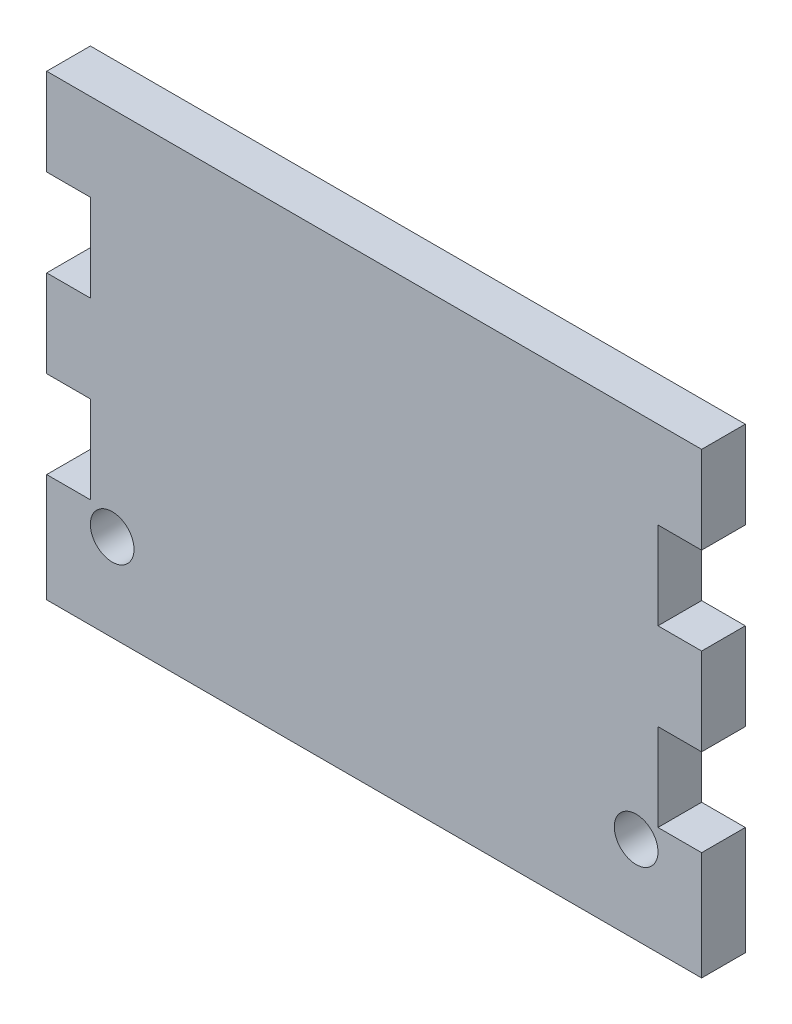
ISO-10303-21;
HEADER;
FILE_DESCRIPTION(('STEP AP214'),'2;1');
FILE_NAME('part.step','',(''),(''),'','','');
FILE_SCHEMA(('AUTOMOTIVE_DESIGN { 1 0 10303 214 1 1 1 1 }'));
ENDSEC;
DATA;
#1=APPLICATION_CONTEXT('core data for automotive mechanical design processes');
#2=APPLICATION_PROTOCOL_DEFINITION('international standard','automotive_design',2000,#1);
#3=PRODUCT_CONTEXT('',#1,'mechanical');
#4=PRODUCT('Part','Part','',(#3));
#5=PRODUCT_RELATED_PRODUCT_CATEGORY('part','',(#4));
#6=PRODUCT_DEFINITION_FORMATION('','',#4);
#7=PRODUCT_DEFINITION_CONTEXT('part definition',#1,'design');
#8=PRODUCT_DEFINITION('design','',#6,#7);
#9=PRODUCT_DEFINITION_SHAPE('','',#8);
#10=(LENGTH_UNIT() NAMED_UNIT(*) SI_UNIT(.MILLI.,.METRE.));
#11=(NAMED_UNIT(*) PLANE_ANGLE_UNIT() SI_UNIT($,.RADIAN.));
#12=(NAMED_UNIT(*) SI_UNIT($,.STERADIAN.) SOLID_ANGLE_UNIT());
#13=UNCERTAINTY_MEASURE_WITH_UNIT(LENGTH_MEASURE(1.E-05),#10,'distance_accuracy_value','');
#14=(GEOMETRIC_REPRESENTATION_CONTEXT(3) GLOBAL_UNCERTAINTY_ASSIGNED_CONTEXT((#13)) GLOBAL_UNIT_ASSIGNED_CONTEXT((#10,
#11,#12)) REPRESENTATION_CONTEXT('',''));
#15=CARTESIAN_POINT('',(0.,0.,0.));
#16=DIRECTION('',(0.,0.,1.));
#17=DIRECTION('',(1.,0.,0.));
#18=AXIS2_PLACEMENT_3D('',#15,#16,#17);
#19=CARTESIAN_POINT('',(95.25,0.,6.35));
#20=DIRECTION('',(-1.,0.,0.));
#21=DIRECTION('',(0.,0.,1.));
#22=AXIS2_PLACEMENT_3D('',#19,#20,#21);
#23=PLANE('',#22);
#24=DIRECTION('',(0.,1.,0.));
#25=VECTOR('',#24,1.);
#26=CARTESIAN_POINT('',(95.25,0.,0.));
#27=LINE('',#26,#25);
#28=CARTESIAN_POINT('',(95.25,-104.683822381819,0.));
#29=VERTEX_POINT('',#28);
#30=CARTESIAN_POINT('',(95.25,-88.9,0.));
#31=VERTEX_POINT('',#30);
#32=EDGE_CURVE('E40',#29,#31,#27,.T.);
#33=ORIENTED_EDGE('',*,*,#32,.T.);
#34=DIRECTION('',(0.,0.,1.));
#35=VECTOR('',#34,1.);
#36=CARTESIAN_POINT('',(95.25,-88.9,0.));
#37=LINE('',#36,#35);
#38=CARTESIAN_POINT('',(95.25,-88.9,6.35));
#39=VERTEX_POINT('',#38);
#40=EDGE_CURVE('E310',#31,#39,#37,.T.);
#41=ORIENTED_EDGE('',*,*,#40,.T.);
#42=DIRECTION('',(0.,1.,0.));
#43=VECTOR('',#42,1.);
#44=CARTESIAN_POINT('',(95.25,0.,6.35));
#45=LINE('',#44,#43);
#46=CARTESIAN_POINT('',(95.25,-104.683822381819,6.35));
#47=VERTEX_POINT('',#46);
#48=EDGE_CURVE('E11',#47,#39,#45,.T.);
#49=ORIENTED_EDGE('',*,*,#48,.F.);
#50=DIRECTION('',(0.,0.,1.));
#51=VECTOR('',#50,1.);
#52=CARTESIAN_POINT('',(95.25,-104.683822381819,0.));
#53=LINE('',#52,#51);
#54=EDGE_CURVE('E217',#29,#47,#53,.T.);
#55=ORIENTED_EDGE('',*,*,#54,.F.);
#56=EDGE_LOOP('',(#33,#41,#49,#55));
#57=FACE_BOUND('',#56,.T.);
#58=ADVANCED_FACE('F36',(#57),#23,.F.);
#59=CARTESIAN_POINT('',(0.,0.,6.35));
#60=DIRECTION('',(1.,0.,0.));
#61=DIRECTION('',(0.,0.,-1.));
#62=AXIS2_PLACEMENT_3D('',#59,#60,#61);
#63=PLANE('',#62);
#64=DIRECTION('',(0.,-1.,0.));
#65=VECTOR('',#64,1.);
#66=CARTESIAN_POINT('',(0.,0.,0.));
#67=LINE('',#66,#65);
#68=CARTESIAN_POINT('',(0.,-63.5,0.));
#69=VERTEX_POINT('',#68);
#70=CARTESIAN_POINT('',(0.,-76.2,0.));
#71=VERTEX_POINT('',#70);
#72=EDGE_CURVE('E210',#69,#71,#67,.T.);
#73=ORIENTED_EDGE('',*,*,#72,.T.);
#74=DIRECTION('',(0.,0.,1.));
#75=VECTOR('',#74,1.);
#76=CARTESIAN_POINT('',(0.,-76.2,0.));
#77=LINE('',#76,#75);
#78=CARTESIAN_POINT('',(0.,-76.2,6.35));
#79=VERTEX_POINT('',#78);
#80=EDGE_CURVE('E335',#71,#79,#77,.T.);
#81=ORIENTED_EDGE('',*,*,#80,.T.);
#82=DIRECTION('',(0.,-1.,0.));
#83=VECTOR('',#82,1.);
#84=CARTESIAN_POINT('',(0.,0.,6.35));
#85=LINE('',#84,#83);
#86=CARTESIAN_POINT('',(0.,-63.5,6.35));
#87=VERTEX_POINT('',#86);
#88=EDGE_CURVE('E236',#87,#79,#85,.T.);
#89=ORIENTED_EDGE('',*,*,#88,.F.);
#90=DIRECTION('',(0.,0.,1.));
#91=VECTOR('',#90,1.);
#92=CARTESIAN_POINT('',(0.,-63.5,0.));
#93=LINE('',#92,#91);
#94=EDGE_CURVE('E284',#69,#87,#93,.T.);
#95=ORIENTED_EDGE('',*,*,#94,.F.);
#96=EDGE_LOOP('',(#73,#81,#89,#95));
#97=FACE_BOUND('',#96,.T.);
#98=ADVANCED_FACE('F372',(#97),#63,.F.);
#99=CARTESIAN_POINT('',(95.25,-76.2,6.35));
#100=VERTEX_POINT('',#99);
#101=CARTESIAN_POINT('',(95.25,-63.5,6.35));
#102=VERTEX_POINT('',#101);
#103=EDGE_CURVE('E45',#100,#102,#45,.T.);
#104=ORIENTED_EDGE('',*,*,#103,.F.);
#105=DIRECTION('',(0.,0.,1.));
#106=VECTOR('',#105,1.);
#107=CARTESIAN_POINT('',(95.25,-76.2,0.));
#108=LINE('',#107,#106);
#109=CARTESIAN_POINT('',(95.25,-76.2,0.));
#110=VERTEX_POINT('',#109);
#111=EDGE_CURVE('E54',#110,#100,#108,.T.);
#112=ORIENTED_EDGE('',*,*,#111,.F.);
#113=CARTESIAN_POINT('',(95.25,-63.5,0.));
#114=VERTEX_POINT('',#113);
#115=EDGE_CURVE('E189',#110,#114,#27,.T.);
#116=ORIENTED_EDGE('',*,*,#115,.T.);
#117=DIRECTION('',(0.,0.,1.));
#118=VECTOR('',#117,1.);
#119=CARTESIAN_POINT('',(95.25,-63.5,0.));
#120=LINE('',#119,#118);
#121=EDGE_CURVE('E257',#114,#102,#120,.T.);
#122=ORIENTED_EDGE('',*,*,#121,.T.);
#123=EDGE_LOOP('',(#104,#112,#116,#122));
#124=FACE_BOUND('',#123,.T.);
#125=ADVANCED_FACE('F187',(#124),#23,.F.);
#126=CARTESIAN_POINT('',(0.,-38.1,0.));
#127=VERTEX_POINT('',#126);
#128=CARTESIAN_POINT('',(0.,-50.8,0.));
#129=VERTEX_POINT('',#128);
#130=EDGE_CURVE('E203',#127,#129,#67,.T.);
#131=ORIENTED_EDGE('',*,*,#130,.T.);
#132=DIRECTION('',(0.,0.,1.));
#133=VECTOR('',#132,1.);
#134=CARTESIAN_POINT('',(0.,-50.8,0.));
#135=LINE('',#134,#133);
#136=CARTESIAN_POINT('',(0.,-50.8,6.35));
#137=VERTEX_POINT('',#136);
#138=EDGE_CURVE('E289',#129,#137,#135,.T.);
#139=ORIENTED_EDGE('',*,*,#138,.T.);
#140=CARTESIAN_POINT('',(0.,-38.1,6.35));
#141=VERTEX_POINT('',#140);
#142=EDGE_CURVE('E237',#141,#137,#85,.T.);
#143=ORIENTED_EDGE('',*,*,#142,.F.);
#144=DIRECTION('',(0.,0.,1.));
#145=VECTOR('',#144,1.);
#146=CARTESIAN_POINT('',(0.,-38.1,0.));
#147=LINE('',#146,#145);
#148=EDGE_CURVE('E301',#127,#141,#147,.T.);
#149=ORIENTED_EDGE('',*,*,#148,.F.);
#150=EDGE_LOOP('',(#131,#139,#143,#149));
#151=FACE_BOUND('',#150,.T.);
#152=ADVANCED_FACE('F357',(#151),#63,.F.);
#153=CARTESIAN_POINT('',(95.25,-50.8,6.35));
#154=VERTEX_POINT('',#153);
#155=CARTESIAN_POINT('',(95.25,-38.1,6.35));
#156=VERTEX_POINT('',#155);
#157=EDGE_CURVE('E47',#154,#156,#45,.T.);
#158=ORIENTED_EDGE('',*,*,#157,.F.);
#159=DIRECTION('',(0.,0.,1.));
#160=VECTOR('',#159,1.);
#161=CARTESIAN_POINT('',(95.25,-50.8,0.));
#162=LINE('',#161,#160);
#163=CARTESIAN_POINT('',(95.25,-50.8,0.));
#164=VERTEX_POINT('',#163);
#165=EDGE_CURVE('E273',#164,#154,#162,.T.);
#166=ORIENTED_EDGE('',*,*,#165,.F.);
#167=CARTESIAN_POINT('',(95.25,-38.1,0.));
#168=VERTEX_POINT('',#167);
#169=EDGE_CURVE('E199',#164,#168,#27,.T.);
#170=ORIENTED_EDGE('',*,*,#169,.T.);
#171=DIRECTION('',(0.,0.,1.));
#172=VECTOR('',#171,1.);
#173=CARTESIAN_POINT('',(95.25,-38.1,0.));
#174=LINE('',#173,#172);
#175=EDGE_CURVE('E291',#168,#156,#174,.T.);
#176=ORIENTED_EDGE('',*,*,#175,.T.);
#177=EDGE_LOOP('',(#158,#166,#170,#176));
#178=FACE_BOUND('',#177,.T.);
#179=ADVANCED_FACE('F354',(#178),#23,.F.);
#180=CARTESIAN_POINT('',(0.,0.,0.));
#181=DIRECTION('',(0.,0.,-1.));
#182=DIRECTION('',(-1.,0.,0.));
#183=AXIS2_PLACEMENT_3D('',#180,#181,#182);
#184=PLANE('',#183);
#185=DIRECTION('',(1.,0.,0.));
#186=VECTOR('',#185,1.);
#187=CARTESIAN_POINT('',(0.,-38.1,0.));
#188=LINE('',#187,#186);
#189=EDGE_CURVE('E299',#127,#168,#188,.T.);
#190=ORIENTED_EDGE('',*,*,#189,.T.);
#191=ORIENTED_EDGE('',*,*,#169,.F.);
#192=DIRECTION('',(-1.,0.,0.));
#193=VECTOR('',#192,1.);
#194=CARTESIAN_POINT('',(95.25,-50.8,0.));
#195=LINE('',#194,#193);
#196=CARTESIAN_POINT('',(88.9,-50.8,0.));
#197=VERTEX_POINT('',#196);
#198=EDGE_CURVE('E260',#164,#197,#195,.T.);
#199=ORIENTED_EDGE('',*,*,#198,.T.);
#200=DIRECTION('',(0.,-1.,0.));
#201=VECTOR('',#200,1.);
#202=CARTESIAN_POINT('',(88.9,-50.8,0.));
#203=LINE('',#202,#201);
#204=CARTESIAN_POINT('',(88.9,-63.5,0.));
#205=VERTEX_POINT('',#204);
#206=EDGE_CURVE('E346',#197,#205,#203,.T.);
#207=ORIENTED_EDGE('',*,*,#206,.T.);
#208=DIRECTION('',(1.,0.,0.));
#209=VECTOR('',#208,1.);
#210=CARTESIAN_POINT('',(95.25,-63.5,0.));
#211=LINE('',#210,#209);
#212=EDGE_CURVE('E198',#205,#114,#211,.T.);
#213=ORIENTED_EDGE('',*,*,#212,.T.);
#214=ORIENTED_EDGE('',*,*,#115,.F.);
#215=DIRECTION('',(-1.,0.,0.));
#216=VECTOR('',#215,1.);
#217=CARTESIAN_POINT('',(95.25,-76.2,0.));
#218=LINE('',#217,#216);
#219=CARTESIAN_POINT('',(88.9,-76.2,0.));
#220=VERTEX_POINT('',#219);
#221=EDGE_CURVE('E175',#110,#220,#218,.T.);
#222=ORIENTED_EDGE('',*,*,#221,.T.);
#223=DIRECTION('',(0.,-1.,0.));
#224=VECTOR('',#223,1.);
#225=CARTESIAN_POINT('',(88.9,-76.2,0.));
#226=LINE('',#225,#224);
#227=CARTESIAN_POINT('',(88.9,-88.9,0.));
#228=VERTEX_POINT('',#227);
#229=EDGE_CURVE('E182',#220,#228,#226,.T.);
#230=ORIENTED_EDGE('',*,*,#229,.T.);
#231=DIRECTION('',(1.,0.,0.));
#232=VECTOR('',#231,1.);
#233=CARTESIAN_POINT('',(95.25,-88.9,0.));
#234=LINE('',#233,#232);
#235=EDGE_CURVE('E191',#228,#31,#234,.T.);
#236=ORIENTED_EDGE('',*,*,#235,.T.);
#237=ORIENTED_EDGE('',*,*,#32,.F.);
#238=DIRECTION('',(1.,0.,0.));
#239=VECTOR('',#238,1.);
#240=CARTESIAN_POINT('',(0.,-104.683822381819,0.));
#241=LINE('',#240,#239);
#242=CARTESIAN_POINT('',(0.,-104.683822381819,0.));
#243=VERTEX_POINT('',#242);
#244=EDGE_CURVE('E230',#243,#29,#241,.T.);
#245=ORIENTED_EDGE('',*,*,#244,.F.);
#246=CARTESIAN_POINT('',(0.,-88.9,0.));
#247=VERTEX_POINT('',#246);
#248=EDGE_CURVE('E211',#247,#243,#67,.T.);
#249=ORIENTED_EDGE('',*,*,#248,.F.);
#250=DIRECTION('',(1.,0.,0.));
#251=VECTOR('',#250,1.);
#252=CARTESIAN_POINT('',(0.,-88.9,0.));
#253=LINE('',#252,#251);
#254=CARTESIAN_POINT('',(6.35,-88.9,0.));
#255=VERTEX_POINT('',#254);
#256=EDGE_CURVE('E62',#247,#255,#253,.T.);
#257=ORIENTED_EDGE('',*,*,#256,.T.);
#258=DIRECTION('',(0.,1.,0.));
#259=VECTOR('',#258,1.);
#260=CARTESIAN_POINT('',(6.35,-76.2,0.));
#261=LINE('',#260,#259);
#262=CARTESIAN_POINT('',(6.35,-76.2,0.));
#263=VERTEX_POINT('',#262);
#264=EDGE_CURVE('E324',#255,#263,#261,.T.);
#265=ORIENTED_EDGE('',*,*,#264,.T.);
#266=DIRECTION('',(-1.,0.,0.));
#267=VECTOR('',#266,1.);
#268=CARTESIAN_POINT('',(0.,-76.2,0.));
#269=LINE('',#268,#267);
#270=EDGE_CURVE('E328',#263,#71,#269,.T.);
#271=ORIENTED_EDGE('',*,*,#270,.T.);
#272=ORIENTED_EDGE('',*,*,#72,.F.);
#273=DIRECTION('',(1.,0.,0.));
#274=VECTOR('',#273,1.);
#275=CARTESIAN_POINT('',(0.,-63.5,0.));
#276=LINE('',#275,#274);
#277=CARTESIAN_POINT('',(6.35,-63.5,0.));
#278=VERTEX_POINT('',#277);
#279=EDGE_CURVE('E275',#69,#278,#276,.T.);
#280=ORIENTED_EDGE('',*,*,#279,.T.);
#281=DIRECTION('',(0.,1.,0.));
#282=VECTOR('',#281,1.);
#283=CARTESIAN_POINT('',(6.35,-50.8,0.));
#284=LINE('',#283,#282);
#285=CARTESIAN_POINT('',(6.35,-50.8,0.));
#286=VERTEX_POINT('',#285);
#287=EDGE_CURVE('E278',#278,#286,#284,.T.);
#288=ORIENTED_EDGE('',*,*,#287,.T.);
#289=DIRECTION('',(-1.,0.,0.));
#290=VECTOR('',#289,1.);
#291=CARTESIAN_POINT('',(0.,-50.8,0.));
#292=LINE('',#291,#290);
#293=EDGE_CURVE('E282',#286,#129,#292,.T.);
#294=ORIENTED_EDGE('',*,*,#293,.T.);
#295=ORIENTED_EDGE('',*,*,#130,.F.);
#296=EDGE_LOOP('',(#190,#191,#199,#207,#213,#214,#222,#230,#236,#237,#245,#249,#257,#265,#271,
#272,#280,#288,#294,#295));
#297=FACE_BOUND('',#296,.T.);
#298=CARTESIAN_POINT('',(85.725,-91.9838223818195,0.));
#299=DIRECTION('',(0.,0.,1.));
#300=DIRECTION('',(1.,0.,0.));
#301=AXIS2_PLACEMENT_3D('',#298,#299,#300);
#302=CIRCLE('',#301,3.175);
#303=CARTESIAN_POINT('',(88.9,-91.9838223818195,0.));
#304=VERTEX_POINT('',#303);
#305=EDGE_CURVE('E425',#304,#304,#302,.T.);
#306=ORIENTED_EDGE('',*,*,#305,.T.);
#307=EDGE_LOOP('',(#306));
#308=FACE_BOUND('',#307,.T.);
#309=CARTESIAN_POINT('',(9.525,-91.9838223818195,0.));
#310=DIRECTION('',(0.,0.,1.));
#311=DIRECTION('',(1.,0.,0.));
#312=AXIS2_PLACEMENT_3D('',#309,#310,#311);
#313=CIRCLE('',#312,3.175);
#314=CARTESIAN_POINT('',(12.7,-91.9838223818195,0.));
#315=VERTEX_POINT('',#314);
#316=EDGE_CURVE('E424',#315,#315,#313,.T.);
#317=ORIENTED_EDGE('',*,*,#316,.T.);
#318=EDGE_LOOP('',(#317));
#319=FACE_BOUND('',#318,.T.);
#320=ADVANCED_FACE('F194',(#297,#308,#319),#184,.T.);
#321=CARTESIAN_POINT('',(0.,0.,6.35));
#322=DIRECTION('',(0.,0.,-1.));
#323=DIRECTION('',(-1.,0.,0.));
#324=AXIS2_PLACEMENT_3D('',#321,#322,#323);
#325=PLANE('',#324);
#326=CARTESIAN_POINT('',(85.725,-91.9838223818195,6.35));
#327=DIRECTION('',(0.,0.,1.));
#328=DIRECTION('',(1.,0.,0.));
#329=AXIS2_PLACEMENT_3D('',#326,#327,#328);
#330=CIRCLE('',#329,3.175);
#331=CARTESIAN_POINT('',(88.9,-91.9838223818195,6.35));
#332=VERTEX_POINT('',#331);
#333=EDGE_CURVE('E419',#332,#332,#330,.T.);
#334=ORIENTED_EDGE('',*,*,#333,.F.);
#335=EDGE_LOOP('',(#334));
#336=FACE_BOUND('',#335,.T.);
#337=CARTESIAN_POINT('',(9.525,-91.9838223818195,6.35));
#338=DIRECTION('',(0.,0.,1.));
#339=DIRECTION('',(1.,0.,0.));
#340=AXIS2_PLACEMENT_3D('',#337,#338,#339);
#341=CIRCLE('',#340,3.175);
#342=CARTESIAN_POINT('',(12.7,-91.9838223818195,6.35));
#343=VERTEX_POINT('',#342);
#344=EDGE_CURVE('E422',#343,#343,#341,.T.);
#345=ORIENTED_EDGE('',*,*,#344,.F.);
#346=EDGE_LOOP('',(#345));
#347=FACE_BOUND('',#346,.T.);
#348=ORIENTED_EDGE('',*,*,#157,.T.);
#349=DIRECTION('',(1.,0.,0.));
#350=VECTOR('',#349,1.);
#351=CARTESIAN_POINT('',(0.,-38.1,6.35));
#352=LINE('',#351,#350);
#353=EDGE_CURVE('E298',#141,#156,#352,.T.);
#354=ORIENTED_EDGE('',*,*,#353,.F.);
#355=ORIENTED_EDGE('',*,*,#142,.T.);
#356=DIRECTION('',(-1.,0.,0.));
#357=VECTOR('',#356,1.);
#358=CARTESIAN_POINT('',(0.,-50.8,6.35));
#359=LINE('',#358,#357);
#360=CARTESIAN_POINT('',(6.35,-50.8,6.35));
#361=VERTEX_POINT('',#360);
#362=EDGE_CURVE('E279',#361,#137,#359,.T.);
#363=ORIENTED_EDGE('',*,*,#362,.F.);
#364=DIRECTION('',(0.,1.,0.));
#365=VECTOR('',#364,1.);
#366=CARTESIAN_POINT('',(6.35,-50.8,6.35));
#367=LINE('',#366,#365);
#368=CARTESIAN_POINT('',(6.35,-63.5,6.35));
#369=VERTEX_POINT('',#368);
#370=EDGE_CURVE('E266',#369,#361,#367,.T.);
#371=ORIENTED_EDGE('',*,*,#370,.F.);
#372=DIRECTION('',(1.,0.,0.));
#373=VECTOR('',#372,1.);
#374=CARTESIAN_POINT('',(0.,-63.5,6.35));
#375=LINE('',#374,#373);
#376=EDGE_CURVE('E263',#87,#369,#375,.T.);
#377=ORIENTED_EDGE('',*,*,#376,.F.);
#378=ORIENTED_EDGE('',*,*,#88,.T.);
#379=DIRECTION('',(-1.,0.,0.));
#380=VECTOR('',#379,1.);
#381=CARTESIAN_POINT('',(0.,-76.2,6.35));
#382=LINE('',#381,#380);
#383=CARTESIAN_POINT('',(6.35,-76.2,6.35));
#384=VERTEX_POINT('',#383);
#385=EDGE_CURVE('E325',#384,#79,#382,.T.);
#386=ORIENTED_EDGE('',*,*,#385,.F.);
#387=DIRECTION('',(0.,1.,0.));
#388=VECTOR('',#387,1.);
#389=CARTESIAN_POINT('',(6.35,-76.2,6.35));
#390=LINE('',#389,#388);
#391=CARTESIAN_POINT('',(6.35,-88.9,6.35));
#392=VERTEX_POINT('',#391);
#393=EDGE_CURVE('E316',#392,#384,#390,.T.);
#394=ORIENTED_EDGE('',*,*,#393,.F.);
#395=DIRECTION('',(1.,0.,0.));
#396=VECTOR('',#395,1.);
#397=CARTESIAN_POINT('',(0.,-88.9,6.35));
#398=LINE('',#397,#396);
#399=CARTESIAN_POINT('',(0.,-88.9,6.35));
#400=VERTEX_POINT('',#399);
#401=EDGE_CURVE('E312',#400,#392,#398,.T.);
#402=ORIENTED_EDGE('',*,*,#401,.F.);
#403=CARTESIAN_POINT('',(0.,-104.683822381819,6.35));
#404=VERTEX_POINT('',#403);
#405=EDGE_CURVE('E201',#400,#404,#85,.T.);
#406=ORIENTED_EDGE('',*,*,#405,.T.);
#407=DIRECTION('',(1.,0.,0.));
#408=VECTOR('',#407,1.);
#409=CARTESIAN_POINT('',(0.,-104.683822381819,6.35));
#410=LINE('',#409,#408);
#411=EDGE_CURVE('E233',#404,#47,#410,.T.);
#412=ORIENTED_EDGE('',*,*,#411,.T.);
#413=ORIENTED_EDGE('',*,*,#48,.T.);
#414=DIRECTION('',(1.,0.,0.));
#415=VECTOR('',#414,1.);
#416=CARTESIAN_POINT('',(95.25,-88.9,6.35));
#417=LINE('',#416,#415);
#418=CARTESIAN_POINT('',(88.9,-88.9,6.35));
#419=VERTEX_POINT('',#418);
#420=EDGE_CURVE('E183',#419,#39,#417,.T.);
#421=ORIENTED_EDGE('',*,*,#420,.F.);
#422=DIRECTION('',(0.,-1.,0.));
#423=VECTOR('',#422,1.);
#424=CARTESIAN_POINT('',(88.9,-76.2,6.35));
#425=LINE('',#424,#423);
#426=CARTESIAN_POINT('',(88.9,-76.2,6.35));
#427=VERTEX_POINT('',#426);
#428=EDGE_CURVE('E435',#427,#419,#425,.T.);
#429=ORIENTED_EDGE('',*,*,#428,.F.);
#430=DIRECTION('',(-1.,0.,0.));
#431=VECTOR('',#430,1.);
#432=CARTESIAN_POINT('',(95.25,-76.2,6.35));
#433=LINE('',#432,#431);
#434=EDGE_CURVE('E254',#100,#427,#433,.T.);
#435=ORIENTED_EDGE('',*,*,#434,.F.);
#436=ORIENTED_EDGE('',*,*,#103,.T.);
#437=DIRECTION('',(1.,0.,0.));
#438=VECTOR('',#437,1.);
#439=CARTESIAN_POINT('',(95.25,-63.5,6.35));
#440=LINE('',#439,#438);
#441=CARTESIAN_POINT('',(88.9,-63.5,6.35));
#442=VERTEX_POINT('',#441);
#443=EDGE_CURVE('E252',#442,#102,#440,.T.);
#444=ORIENTED_EDGE('',*,*,#443,.F.);
#445=DIRECTION('',(0.,-1.,0.));
#446=VECTOR('',#445,1.);
#447=CARTESIAN_POINT('',(88.9,-50.8,6.35));
#448=LINE('',#447,#446);
#449=CARTESIAN_POINT('',(88.9,-50.8,6.35));
#450=VERTEX_POINT('',#449);
#451=EDGE_CURVE('E261',#450,#442,#448,.T.);
#452=ORIENTED_EDGE('',*,*,#451,.F.);
#453=DIRECTION('',(-1.,0.,0.));
#454=VECTOR('',#453,1.);
#455=CARTESIAN_POINT('',(95.25,-50.8,6.35));
#456=LINE('',#455,#454);
#457=EDGE_CURVE('E338',#154,#450,#456,.T.);
#458=ORIENTED_EDGE('',*,*,#457,.F.);
#459=EDGE_LOOP('',(#348,#354,#355,#363,#371,#377,#378,#386,#394,#402,#406,#412,#413,#421,#429,
#435,#436,#444,#452,#458));
#460=FACE_BOUND('',#459,.T.);
#461=ADVANCED_FACE('F38',(#336,#347,#460),#325,.F.);
#462=ORIENTED_EDGE('',*,*,#405,.F.);
#463=DIRECTION('',(0.,0.,1.));
#464=VECTOR('',#463,1.);
#465=CARTESIAN_POINT('',(0.,-88.9,0.));
#466=LINE('',#465,#464);
#467=EDGE_CURVE('E330',#247,#400,#466,.T.);
#468=ORIENTED_EDGE('',*,*,#467,.F.);
#469=ORIENTED_EDGE('',*,*,#248,.T.);
#470=DIRECTION('',(0.,0.,1.));
#471=VECTOR('',#470,1.);
#472=CARTESIAN_POINT('',(0.,-104.683822381819,0.));
#473=LINE('',#472,#471);
#474=EDGE_CURVE('E223',#243,#404,#473,.T.);
#475=ORIENTED_EDGE('',*,*,#474,.T.);
#476=EDGE_LOOP('',(#462,#468,#469,#475));
#477=FACE_BOUND('',#476,.T.);
#478=ADVANCED_FACE('F380',(#477),#63,.F.);
#479=CARTESIAN_POINT('',(0.,-104.683822381819,0.));
#480=DIRECTION('',(0.,-1.,0.));
#481=DIRECTION('',(0.,0.,-1.));
#482=AXIS2_PLACEMENT_3D('',#479,#480,#481);
#483=PLANE('',#482);
#484=ORIENTED_EDGE('',*,*,#411,.F.);
#485=ORIENTED_EDGE('',*,*,#474,.F.);
#486=ORIENTED_EDGE('',*,*,#244,.T.);
#487=ORIENTED_EDGE('',*,*,#54,.T.);
#488=EDGE_LOOP('',(#484,#485,#486,#487));
#489=FACE_BOUND('',#488,.T.);
#490=ADVANCED_FACE('F305',(#489),#483,.T.);
#491=CARTESIAN_POINT('',(0.,-38.1,0.));
#492=DIRECTION('',(0.,-1.,0.));
#493=DIRECTION('',(1.,0.,0.));
#494=AXIS2_PLACEMENT_3D('',#491,#492,#493);
#495=PLANE('',#494);
#496=ORIENTED_EDGE('',*,*,#353,.T.);
#497=ORIENTED_EDGE('',*,*,#175,.F.);
#498=ORIENTED_EDGE('',*,*,#189,.F.);
#499=ORIENTED_EDGE('',*,*,#148,.T.);
#500=EDGE_LOOP('',(#496,#497,#498,#499));
#501=FACE_BOUND('',#500,.T.);
#502=ADVANCED_FACE('F356',(#501),#495,.F.);
#503=CARTESIAN_POINT('',(0.,-50.8,0.));
#504=DIRECTION('',(0.,1.,0.));
#505=DIRECTION('',(0.,0.,1.));
#506=AXIS2_PLACEMENT_3D('',#503,#504,#505);
#507=PLANE('',#506);
#508=ORIENTED_EDGE('',*,*,#362,.T.);
#509=ORIENTED_EDGE('',*,*,#138,.F.);
#510=ORIENTED_EDGE('',*,*,#293,.F.);
#511=DIRECTION('',(0.,0.,1.));
#512=VECTOR('',#511,1.);
#513=CARTESIAN_POINT('',(6.35,-50.8,0.));
#514=LINE('',#513,#512);
#515=EDGE_CURVE('E292',#286,#361,#514,.T.);
#516=ORIENTED_EDGE('',*,*,#515,.T.);
#517=EDGE_LOOP('',(#508,#509,#510,#516));
#518=FACE_BOUND('',#517,.T.);
#519=ADVANCED_FACE('F360',(#518),#507,.F.);
#520=CARTESIAN_POINT('',(6.35,-50.8,0.));
#521=DIRECTION('',(1.,0.,0.));
#522=DIRECTION('',(0.,1.,0.));
#523=AXIS2_PLACEMENT_3D('',#520,#521,#522);
#524=PLANE('',#523);
#525=ORIENTED_EDGE('',*,*,#370,.T.);
#526=ORIENTED_EDGE('',*,*,#515,.F.);
#527=ORIENTED_EDGE('',*,*,#287,.F.);
#528=DIRECTION('',(0.,0.,1.));
#529=VECTOR('',#528,1.);
#530=CARTESIAN_POINT('',(6.35,-63.5,0.));
#531=LINE('',#530,#529);
#532=EDGE_CURVE('E294',#278,#369,#531,.T.);
#533=ORIENTED_EDGE('',*,*,#532,.T.);
#534=EDGE_LOOP('',(#525,#526,#527,#533));
#535=FACE_BOUND('',#534,.T.);
#536=ADVANCED_FACE('F364',(#535),#524,.F.);
#537=CARTESIAN_POINT('',(0.,-63.5,0.));
#538=DIRECTION('',(0.,-1.,0.));
#539=DIRECTION('',(1.,0.,0.));
#540=AXIS2_PLACEMENT_3D('',#537,#538,#539);
#541=PLANE('',#540);
#542=ORIENTED_EDGE('',*,*,#376,.T.);
#543=ORIENTED_EDGE('',*,*,#532,.F.);
#544=ORIENTED_EDGE('',*,*,#279,.F.);
#545=ORIENTED_EDGE('',*,*,#94,.T.);
#546=EDGE_LOOP('',(#542,#543,#544,#545));
#547=FACE_BOUND('',#546,.T.);
#548=ADVANCED_FACE('F462',(#547),#541,.F.);
#549=CARTESIAN_POINT('',(95.25,-63.5,0.));
#550=DIRECTION('',(0.,-1.,0.));
#551=DIRECTION('',(0.,0.,-1.));
#552=AXIS2_PLACEMENT_3D('',#549,#550,#551);
#553=PLANE('',#552);
#554=ORIENTED_EDGE('',*,*,#443,.T.);
#555=ORIENTED_EDGE('',*,*,#121,.F.);
#556=ORIENTED_EDGE('',*,*,#212,.F.);
#557=DIRECTION('',(0.,0.,1.));
#558=VECTOR('',#557,1.);
#559=CARTESIAN_POINT('',(88.9,-63.5,0.));
#560=LINE('',#559,#558);
#561=EDGE_CURVE('E258',#205,#442,#560,.T.);
#562=ORIENTED_EDGE('',*,*,#561,.T.);
#563=EDGE_LOOP('',(#554,#555,#556,#562));
#564=FACE_BOUND('',#563,.T.);
#565=ADVANCED_FACE('F256',(#564),#553,.F.);
#566=CARTESIAN_POINT('',(88.9,-50.8,0.));
#567=DIRECTION('',(-1.,0.,0.));
#568=DIRECTION('',(0.,0.,1.));
#569=AXIS2_PLACEMENT_3D('',#566,#567,#568);
#570=PLANE('',#569);
#571=ORIENTED_EDGE('',*,*,#451,.T.);
#572=ORIENTED_EDGE('',*,*,#561,.F.);
#573=ORIENTED_EDGE('',*,*,#206,.F.);
#574=DIRECTION('',(0.,0.,1.));
#575=VECTOR('',#574,1.);
#576=CARTESIAN_POINT('',(88.9,-50.8,0.));
#577=LINE('',#576,#575);
#578=EDGE_CURVE('E268',#197,#450,#577,.T.);
#579=ORIENTED_EDGE('',*,*,#578,.T.);
#580=EDGE_LOOP('',(#571,#572,#573,#579));
#581=FACE_BOUND('',#580,.T.);
#582=ADVANCED_FACE('F351',(#581),#570,.F.);
#583=CARTESIAN_POINT('',(95.25,-50.8,0.));
#584=DIRECTION('',(0.,1.,0.));
#585=DIRECTION('',(-1.,0.,0.));
#586=AXIS2_PLACEMENT_3D('',#583,#584,#585);
#587=PLANE('',#586);
#588=ORIENTED_EDGE('',*,*,#457,.T.);
#589=ORIENTED_EDGE('',*,*,#578,.F.);
#590=ORIENTED_EDGE('',*,*,#198,.F.);
#591=ORIENTED_EDGE('',*,*,#165,.T.);
#592=EDGE_LOOP('',(#588,#589,#590,#591));
#593=FACE_BOUND('',#592,.T.);
#594=ADVANCED_FACE('F448',(#593),#587,.F.);
#595=CARTESIAN_POINT('',(0.,-76.2,0.));
#596=DIRECTION('',(0.,1.,0.));
#597=DIRECTION('',(0.,0.,1.));
#598=AXIS2_PLACEMENT_3D('',#595,#596,#597);
#599=PLANE('',#598);
#600=ORIENTED_EDGE('',*,*,#385,.T.);
#601=ORIENTED_EDGE('',*,*,#80,.F.);
#602=ORIENTED_EDGE('',*,*,#270,.F.);
#603=DIRECTION('',(0.,0.,1.));
#604=VECTOR('',#603,1.);
#605=CARTESIAN_POINT('',(6.35,-76.2,0.));
#606=LINE('',#605,#604);
#607=EDGE_CURVE('E339',#263,#384,#606,.T.);
#608=ORIENTED_EDGE('',*,*,#607,.T.);
#609=EDGE_LOOP('',(#600,#601,#602,#608));
#610=FACE_BOUND('',#609,.T.);
#611=ADVANCED_FACE('F375',(#610),#599,.F.);
#612=CARTESIAN_POINT('',(6.35,-76.2,0.));
#613=DIRECTION('',(1.,0.,0.));
#614=DIRECTION('',(0.,1.,0.));
#615=AXIS2_PLACEMENT_3D('',#612,#613,#614);
#616=PLANE('',#615);
#617=ORIENTED_EDGE('',*,*,#393,.T.);
#618=ORIENTED_EDGE('',*,*,#607,.F.);
#619=ORIENTED_EDGE('',*,*,#264,.F.);
#620=DIRECTION('',(0.,0.,1.));
#621=VECTOR('',#620,1.);
#622=CARTESIAN_POINT('',(6.35,-88.9,0.));
#623=LINE('',#622,#621);
#624=EDGE_CURVE('E341',#255,#392,#623,.T.);
#625=ORIENTED_EDGE('',*,*,#624,.T.);
#626=EDGE_LOOP('',(#617,#618,#619,#625));
#627=FACE_BOUND('',#626,.T.);
#628=ADVANCED_FACE('F378',(#627),#616,.F.);
#629=CARTESIAN_POINT('',(0.,-88.9,0.));
#630=DIRECTION('',(0.,-1.,0.));
#631=DIRECTION('',(1.,0.,0.));
#632=AXIS2_PLACEMENT_3D('',#629,#630,#631);
#633=PLANE('',#632);
#634=ORIENTED_EDGE('',*,*,#401,.T.);
#635=ORIENTED_EDGE('',*,*,#624,.F.);
#636=ORIENTED_EDGE('',*,*,#256,.F.);
#637=ORIENTED_EDGE('',*,*,#467,.T.);
#638=EDGE_LOOP('',(#634,#635,#636,#637));
#639=FACE_BOUND('',#638,.T.);
#640=ADVANCED_FACE('F381',(#639),#633,.F.);
#641=CARTESIAN_POINT('',(95.25,-88.9,0.));
#642=DIRECTION('',(0.,-1.,0.));
#643=DIRECTION('',(0.,0.,-1.));
#644=AXIS2_PLACEMENT_3D('',#641,#642,#643);
#645=PLANE('',#644);
#646=ORIENTED_EDGE('',*,*,#420,.T.);
#647=ORIENTED_EDGE('',*,*,#40,.F.);
#648=ORIENTED_EDGE('',*,*,#235,.F.);
#649=DIRECTION('',(0.,0.,1.));
#650=VECTOR('',#649,1.);
#651=CARTESIAN_POINT('',(88.9,-88.9,0.));
#652=LINE('',#651,#650);
#653=EDGE_CURVE('E313',#228,#419,#652,.T.);
#654=ORIENTED_EDGE('',*,*,#653,.T.);
#655=EDGE_LOOP('',(#646,#647,#648,#654));
#656=FACE_BOUND('',#655,.T.);
#657=ADVANCED_FACE('F383',(#656),#645,.F.);
#658=CARTESIAN_POINT('',(88.9,-76.2,0.));
#659=DIRECTION('',(-1.,0.,0.));
#660=DIRECTION('',(0.,0.,1.));
#661=AXIS2_PLACEMENT_3D('',#658,#659,#660);
#662=PLANE('',#661);
#663=ORIENTED_EDGE('',*,*,#428,.T.);
#664=ORIENTED_EDGE('',*,*,#653,.F.);
#665=ORIENTED_EDGE('',*,*,#229,.F.);
#666=DIRECTION('',(0.,0.,1.));
#667=VECTOR('',#666,1.);
#668=CARTESIAN_POINT('',(88.9,-76.2,0.));
#669=LINE('',#668,#667);
#670=EDGE_CURVE('E177',#220,#427,#669,.T.);
#671=ORIENTED_EDGE('',*,*,#670,.T.);
#672=EDGE_LOOP('',(#663,#664,#665,#671));
#673=FACE_BOUND('',#672,.T.);
#674=ADVANCED_FACE('F389',(#673),#662,.F.);
#675=CARTESIAN_POINT('',(95.25,-76.2,0.));
#676=DIRECTION('',(0.,1.,0.));
#677=DIRECTION('',(-1.,0.,0.));
#678=AXIS2_PLACEMENT_3D('',#675,#676,#677);
#679=PLANE('',#678);
#680=ORIENTED_EDGE('',*,*,#434,.T.);
#681=ORIENTED_EDGE('',*,*,#670,.F.);
#682=ORIENTED_EDGE('',*,*,#221,.F.);
#683=ORIENTED_EDGE('',*,*,#111,.T.);
#684=EDGE_LOOP('',(#680,#681,#682,#683));
#685=FACE_BOUND('',#684,.T.);
#686=ADVANCED_FACE('F176',(#685),#679,.F.);
#687=CARTESIAN_POINT('',(9.525,-91.9838223818195,0.));
#688=DIRECTION('',(0.,0.,1.));
#689=DIRECTION('',(1.,0.,0.));
#690=AXIS2_PLACEMENT_3D('',#687,#688,#689);
#691=CYLINDRICAL_SURFACE('',#690,3.175);
#692=ORIENTED_EDGE('',*,*,#316,.F.);
#693=EDGE_LOOP('',(#692));
#694=FACE_BOUND('',#693,.T.);
#695=ORIENTED_EDGE('',*,*,#344,.T.);
#696=EDGE_LOOP('',(#695));
#697=FACE_BOUND('',#696,.T.);
#698=ADVANCED_FACE('F443',(#694,#697),#691,.F.);
#699=CARTESIAN_POINT('',(85.725,-91.9838223818195,0.));
#700=DIRECTION('',(0.,0.,1.));
#701=DIRECTION('',(1.,0.,0.));
#702=AXIS2_PLACEMENT_3D('',#699,#700,#701);
#703=CYLINDRICAL_SURFACE('',#702,3.175);
#704=ORIENTED_EDGE('',*,*,#305,.F.);
#705=EDGE_LOOP('',(#704));
#706=FACE_BOUND('',#705,.T.);
#707=ORIENTED_EDGE('',*,*,#333,.T.);
#708=EDGE_LOOP('',(#707));
#709=FACE_BOUND('',#708,.T.);
#710=ADVANCED_FACE('F534',(#706,#709),#703,.F.);
#711=CLOSED_SHELL('',(#58,#98,#125,#152,#179,#320,#461,#478,#490,#502,#519,#536,#548,#565,#582,
#594,#611,#628,#640,#657,#674,#686,#698,#710));
#712=MANIFOLD_SOLID_BREP('B2',#711);
#713=ADVANCED_BREP_SHAPE_REPRESENTATION('',(#18,#712),#14);
#714=SHAPE_DEFINITION_REPRESENTATION(#9,#713);
ENDSEC;
END-ISO-10303-21;
